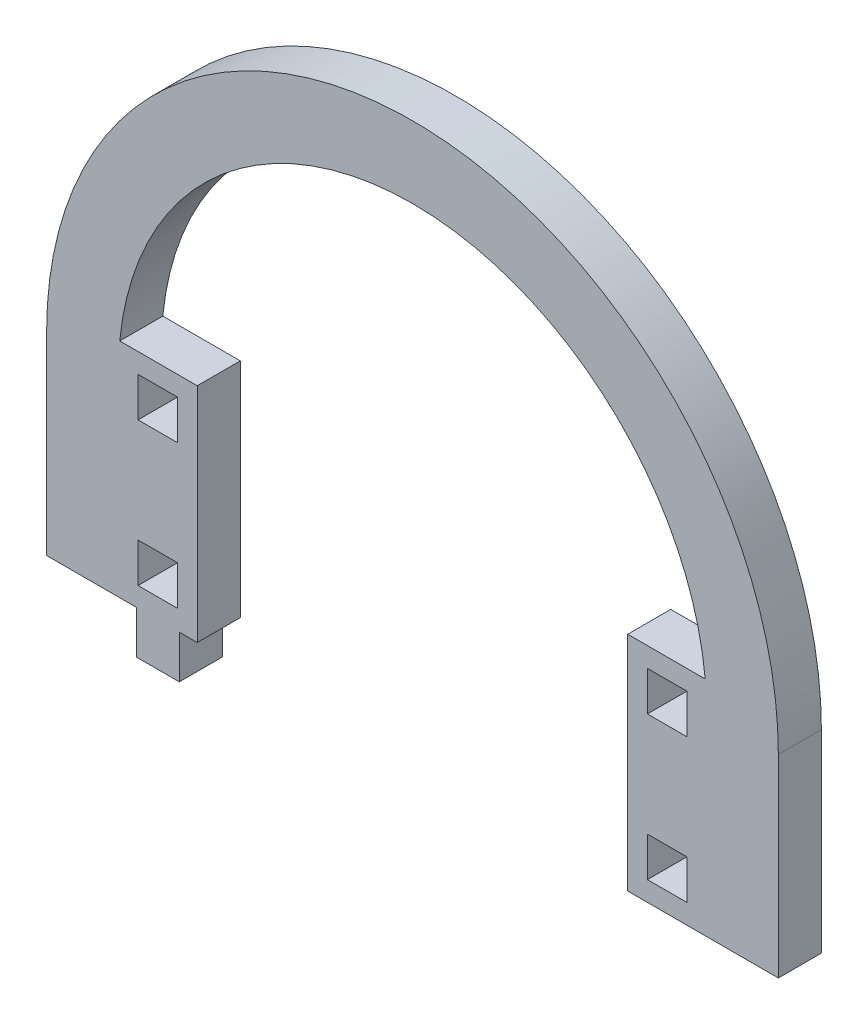
ISO-10303-21;
HEADER;
FILE_DESCRIPTION(('STEP AP214'),'2;1');
FILE_NAME('part.step','',(''),(''),'','','');
FILE_SCHEMA(('AUTOMOTIVE_DESIGN { 1 0 10303 214 1 1 1 1 }'));
ENDSEC;
DATA;
#1=APPLICATION_CONTEXT('core data for automotive mechanical design processes');
#2=APPLICATION_PROTOCOL_DEFINITION('international standard','automotive_design',2000,#1);
#3=PRODUCT_CONTEXT('',#1,'mechanical');
#4=PRODUCT('Part','Part','',(#3));
#5=PRODUCT_RELATED_PRODUCT_CATEGORY('part','',(#4));
#6=PRODUCT_DEFINITION_FORMATION('','',#4);
#7=PRODUCT_DEFINITION_CONTEXT('part definition',#1,'design');
#8=PRODUCT_DEFINITION('design','',#6,#7);
#9=PRODUCT_DEFINITION_SHAPE('','',#8);
#10=(LENGTH_UNIT() NAMED_UNIT(*) SI_UNIT(.MILLI.,.METRE.));
#11=(NAMED_UNIT(*) PLANE_ANGLE_UNIT() SI_UNIT($,.RADIAN.));
#12=(NAMED_UNIT(*) SI_UNIT($,.STERADIAN.) SOLID_ANGLE_UNIT());
#13=UNCERTAINTY_MEASURE_WITH_UNIT(LENGTH_MEASURE(1.E-05),#10,'distance_accuracy_value','');
#14=(GEOMETRIC_REPRESENTATION_CONTEXT(3) GLOBAL_UNCERTAINTY_ASSIGNED_CONTEXT((#13)) GLOBAL_UNIT_ASSIGNED_CONTEXT((#10,
#11,#12)) REPRESENTATION_CONTEXT('',''));
#15=CARTESIAN_POINT('',(0.,0.,0.));
#16=DIRECTION('',(0.,0.,1.));
#17=DIRECTION('',(1.,0.,0.));
#18=AXIS2_PLACEMENT_3D('',#15,#16,#17);
#19=CARTESIAN_POINT('',(3230.49866666937,1276.78177014644,6.));
#20=DIRECTION('',(0.,0.,1.));
#21=DIRECTION('',(1.,0.,0.));
#22=AXIS2_PLACEMENT_3D('',#19,#20,#21);
#23=PLANE('',#22);
#24=CARTESIAN_POINT('',(3230.49866666937,1276.78177014644,6.));
#25=DIRECTION('',(0.,0.,1.));
#26=DIRECTION('',(1.,0.,0.));
#27=AXIS2_PLACEMENT_3D('',#24,#25,#26);
#28=CIRCLE('',#27,50.9999999999999);
#29=CARTESIAN_POINT('',(3281.49866666937,1276.78177014644,6.));
#30=VERTEX_POINT('',#29);
#31=CARTESIAN_POINT('',(3179.49866666937,1276.78177014644,6.));
#32=VERTEX_POINT('',#31);
#33=EDGE_CURVE('E642',#30,#32,#28,.T.);
#34=ORIENTED_EDGE('',*,*,#33,.T.);
#35=DIRECTION('',(0.,-1.,0.));
#36=VECTOR('',#35,1.);
#37=CARTESIAN_POINT('',(3179.49866666937,1276.78177014644,6.));
#38=LINE('',#37,#36);
#39=CARTESIAN_POINT('',(3179.49866666937,1249.78177014644,6.));
#40=VERTEX_POINT('',#39);
#41=EDGE_CURVE('E646',#32,#40,#38,.T.);
#42=ORIENTED_EDGE('',*,*,#41,.T.);
#43=DIRECTION('',(1.,0.,0.));
#44=VECTOR('',#43,1.);
#45=CARTESIAN_POINT('',(3179.49866666937,1249.78177014644,6.));
#46=LINE('',#45,#44);
#47=CARTESIAN_POINT('',(3191.99866666937,1249.78177014644,6.));
#48=VERTEX_POINT('',#47);
#49=EDGE_CURVE('E650',#40,#48,#46,.T.);
#50=ORIENTED_EDGE('',*,*,#49,.T.);
#51=DIRECTION('',(0.,-1.,0.));
#52=VECTOR('',#51,1.);
#53=CARTESIAN_POINT('',(3191.99866666937,1249.78177014644,6.));
#54=LINE('',#53,#52);
#55=CARTESIAN_POINT('',(3191.99866666937,1243.78177014644,6.));
#56=VERTEX_POINT('',#55);
#57=EDGE_CURVE('E653',#48,#56,#54,.T.);
#58=ORIENTED_EDGE('',*,*,#57,.T.);
#59=DIRECTION('',(1.,0.,0.));
#60=VECTOR('',#59,1.);
#61=CARTESIAN_POINT('',(3191.99866666937,1243.78177014644,6.));
#62=LINE('',#61,#60);
#63=CARTESIAN_POINT('',(3197.99866666937,1243.78177014644,6.));
#64=VERTEX_POINT('',#63);
#65=EDGE_CURVE('E656',#56,#64,#62,.T.);
#66=ORIENTED_EDGE('',*,*,#65,.T.);
#67=DIRECTION('',(0.,1.,0.));
#68=VECTOR('',#67,1.);
#69=CARTESIAN_POINT('',(3197.99866666937,1243.78177014644,6.));
#70=LINE('',#69,#68);
#71=CARTESIAN_POINT('',(3197.99866666937,1249.78177014644,6.));
#72=VERTEX_POINT('',#71);
#73=EDGE_CURVE('E659',#64,#72,#70,.T.);
#74=ORIENTED_EDGE('',*,*,#73,.T.);
#75=DIRECTION('',(1.,0.,0.));
#76=VECTOR('',#75,1.);
#77=CARTESIAN_POINT('',(3197.99866666937,1249.78177014644,6.));
#78=LINE('',#77,#76);
#79=CARTESIAN_POINT('',(3200.49866666937,1249.78177014644,6.));
#80=VERTEX_POINT('',#79);
#81=EDGE_CURVE('E662',#72,#80,#78,.T.);
#82=ORIENTED_EDGE('',*,*,#81,.T.);
#83=DIRECTION('',(0.,-1.,0.));
#84=VECTOR('',#83,1.);
#85=CARTESIAN_POINT('',(3200.49866666937,1280.78177014644,6.));
#86=LINE('',#85,#84);
#87=CARTESIAN_POINT('',(3200.49866666937,1280.78177014644,6.));
#88=VERTEX_POINT('',#87);
#89=EDGE_CURVE('E665',#88,#80,#86,.T.);
#90=ORIENTED_EDGE('',*,*,#89,.F.);
#91=DIRECTION('',(-1.,0.,0.));
#92=VECTOR('',#91,1.);
#93=CARTESIAN_POINT('',(3200.49866666937,1280.78177014644,6.));
#94=LINE('',#93,#92);
#95=CARTESIAN_POINT('',(3189.69425514316,1280.78177014644,6.));
#96=VERTEX_POINT('',#95);
#97=EDGE_CURVE('E669',#88,#96,#94,.T.);
#98=ORIENTED_EDGE('',*,*,#97,.T.);
#99=CARTESIAN_POINT('',(3230.49866666937,1276.78177014644,6.));
#100=DIRECTION('',(0.,0.,1.));
#101=DIRECTION('',(1.,0.,0.));
#102=AXIS2_PLACEMENT_3D('',#99,#100,#101);
#103=CIRCLE('',#102,41.0000000000003);
#104=CARTESIAN_POINT('',(3271.30307819558,1280.78177014644,6.));
#105=VERTEX_POINT('',#104);
#106=EDGE_CURVE('E672',#105,#96,#103,.T.);
#107=ORIENTED_EDGE('',*,*,#106,.F.);
#108=DIRECTION('',(-1.,0.,0.));
#109=VECTOR('',#108,1.);
#110=CARTESIAN_POINT('',(3271.30307819558,1280.78177014644,6.));
#111=LINE('',#110,#109);
#112=CARTESIAN_POINT('',(3260.49866666937,1280.78177014644,6.));
#113=VERTEX_POINT('',#112);
#114=EDGE_CURVE('E676',#105,#113,#111,.T.);
#115=ORIENTED_EDGE('',*,*,#114,.T.);
#116=DIRECTION('',(0.,-1.,0.));
#117=VECTOR('',#116,1.);
#118=CARTESIAN_POINT('',(3260.49866666937,1280.78177014644,6.));
#119=LINE('',#118,#117);
#120=CARTESIAN_POINT('',(3260.49866666937,1249.78177014644,6.));
#121=VERTEX_POINT('',#120);
#122=EDGE_CURVE('E679',#113,#121,#119,.T.);
#123=ORIENTED_EDGE('',*,*,#122,.T.);
#124=DIRECTION('',(1.,0.,0.));
#125=VECTOR('',#124,1.);
#126=CARTESIAN_POINT('',(3260.49866666937,1249.78177014644,6.));
#127=LINE('',#126,#125);
#128=CARTESIAN_POINT('',(3281.49866666937,1249.78177014644,6.));
#129=VERTEX_POINT('',#128);
#130=EDGE_CURVE('E682',#121,#129,#127,.T.);
#131=ORIENTED_EDGE('',*,*,#130,.T.);
#132=DIRECTION('',(0.,-1.,0.));
#133=VECTOR('',#132,1.);
#134=CARTESIAN_POINT('',(3281.49866666937,1276.78177014644,6.));
#135=LINE('',#134,#133);
#136=EDGE_CURVE('E685',#30,#129,#135,.T.);
#137=ORIENTED_EDGE('',*,*,#136,.F.);
#138=EDGE_LOOP('',(#34,#42,#50,#58,#66,#74,#82,#90,#98,#107,#115,#123,#131,#137));
#139=FACE_BOUND('',#138,.T.);
#140=DIRECTION('',(0.,1.,0.));
#141=VECTOR('',#140,1.);
#142=CARTESIAN_POINT('',(3197.74866666937,0.,6.));
#143=LINE('',#142,#141);
#144=CARTESIAN_POINT('',(3197.74866666937,1272.53177014644,6.));
#145=VERTEX_POINT('',#144);
#146=CARTESIAN_POINT('',(3197.74866666937,1278.03177014644,6.));
#147=VERTEX_POINT('',#146);
#148=EDGE_CURVE('E602',#145,#147,#143,.T.);
#149=ORIENTED_EDGE('',*,*,#148,.F.);
#150=DIRECTION('',(1.,0.,0.));
#151=VECTOR('',#150,1.);
#152=CARTESIAN_POINT('',(0.,1272.53177014644,6.));
#153=LINE('',#152,#151);
#154=CARTESIAN_POINT('',(3192.24866666937,1272.53177014644,6.));
#155=VERTEX_POINT('',#154);
#156=EDGE_CURVE('E599',#155,#145,#153,.T.);
#157=ORIENTED_EDGE('',*,*,#156,.F.);
#158=DIRECTION('',(0.,-1.,0.));
#159=VECTOR('',#158,1.);
#160=CARTESIAN_POINT('',(3192.24866666937,0.,6.));
#161=LINE('',#160,#159);
#162=CARTESIAN_POINT('',(3192.24866666937,1278.03177014644,6.));
#163=VERTEX_POINT('',#162);
#164=EDGE_CURVE('E610',#163,#155,#161,.T.);
#165=ORIENTED_EDGE('',*,*,#164,.F.);
#166=DIRECTION('',(-1.,0.,0.));
#167=VECTOR('',#166,1.);
#168=CARTESIAN_POINT('',(0.,1278.03177014644,6.));
#169=LINE('',#168,#167);
#170=EDGE_CURVE('E606',#147,#163,#169,.T.);
#171=ORIENTED_EDGE('',*,*,#170,.F.);
#172=EDGE_LOOP('',(#149,#157,#165,#171));
#173=FACE_BOUND('',#172,.T.);
#174=DIRECTION('',(0.,1.,0.));
#175=VECTOR('',#174,1.);
#176=CARTESIAN_POINT('',(3197.74866666937,0.,6.));
#177=LINE('',#176,#175);
#178=CARTESIAN_POINT('',(3197.74866666937,1252.53177014644,6.));
#179=VERTEX_POINT('',#178);
#180=CARTESIAN_POINT('',(3197.74866666937,1258.03177014644,6.));
#181=VERTEX_POINT('',#180);
#182=EDGE_CURVE('E559',#179,#181,#177,.T.);
#183=ORIENTED_EDGE('',*,*,#182,.F.);
#184=DIRECTION('',(1.,0.,0.));
#185=VECTOR('',#184,1.);
#186=CARTESIAN_POINT('',(0.,1252.53177014644,6.));
#187=LINE('',#186,#185);
#188=CARTESIAN_POINT('',(3192.24866666937,1252.53177014644,6.));
#189=VERTEX_POINT('',#188);
#190=EDGE_CURVE('E556',#189,#179,#187,.T.);
#191=ORIENTED_EDGE('',*,*,#190,.F.);
#192=DIRECTION('',(0.,-1.,0.));
#193=VECTOR('',#192,1.);
#194=CARTESIAN_POINT('',(3192.24866666937,0.,6.));
#195=LINE('',#194,#193);
#196=CARTESIAN_POINT('',(3192.24866666937,1258.03177014644,6.));
#197=VERTEX_POINT('',#196);
#198=EDGE_CURVE('E567',#197,#189,#195,.T.);
#199=ORIENTED_EDGE('',*,*,#198,.F.);
#200=DIRECTION('',(-1.,0.,0.));
#201=VECTOR('',#200,1.);
#202=CARTESIAN_POINT('',(0.,1258.03177014644,6.));
#203=LINE('',#202,#201);
#204=EDGE_CURVE('E563',#181,#197,#203,.T.);
#205=ORIENTED_EDGE('',*,*,#204,.F.);
#206=EDGE_LOOP('',(#183,#191,#199,#205));
#207=FACE_BOUND('',#206,.T.);
#208=DIRECTION('',(0.,1.,0.));
#209=VECTOR('',#208,1.);
#210=CARTESIAN_POINT('',(3268.74866666937,0.,6.));
#211=LINE('',#210,#209);
#212=CARTESIAN_POINT('',(3268.74866666937,1272.53177014644,6.));
#213=VERTEX_POINT('',#212);
#214=CARTESIAN_POINT('',(3268.74866666937,1278.03177014644,6.));
#215=VERTEX_POINT('',#214);
#216=EDGE_CURVE('E516',#213,#215,#211,.T.);
#217=ORIENTED_EDGE('',*,*,#216,.F.);
#218=DIRECTION('',(1.,0.,0.));
#219=VECTOR('',#218,1.);
#220=CARTESIAN_POINT('',(0.,1272.53177014644,6.));
#221=LINE('',#220,#219);
#222=CARTESIAN_POINT('',(3263.24866666937,1272.53177014644,6.));
#223=VERTEX_POINT('',#222);
#224=EDGE_CURVE('E513',#223,#213,#221,.T.);
#225=ORIENTED_EDGE('',*,*,#224,.F.);
#226=DIRECTION('',(0.,-1.,0.));
#227=VECTOR('',#226,1.);
#228=CARTESIAN_POINT('',(3263.24866666937,0.,6.));
#229=LINE('',#228,#227);
#230=CARTESIAN_POINT('',(3263.24866666937,1278.03177014644,6.));
#231=VERTEX_POINT('',#230);
#232=EDGE_CURVE('E524',#231,#223,#229,.T.);
#233=ORIENTED_EDGE('',*,*,#232,.F.);
#234=DIRECTION('',(-1.,0.,0.));
#235=VECTOR('',#234,1.);
#236=CARTESIAN_POINT('',(0.,1278.03177014644,6.));
#237=LINE('',#236,#235);
#238=EDGE_CURVE('E520',#215,#231,#237,.T.);
#239=ORIENTED_EDGE('',*,*,#238,.F.);
#240=EDGE_LOOP('',(#217,#225,#233,#239));
#241=FACE_BOUND('',#240,.T.);
#242=DIRECTION('',(0.,1.,0.));
#243=VECTOR('',#242,1.);
#244=CARTESIAN_POINT('',(3268.74866666937,0.,6.));
#245=LINE('',#244,#243);
#246=CARTESIAN_POINT('',(3268.74866666937,1252.53177014644,6.));
#247=VERTEX_POINT('',#246);
#248=CARTESIAN_POINT('',(3268.74866666937,1258.03177014644,6.));
#249=VERTEX_POINT('',#248);
#250=EDGE_CURVE('E474',#247,#249,#245,.T.);
#251=ORIENTED_EDGE('',*,*,#250,.F.);
#252=DIRECTION('',(1.,0.,0.));
#253=VECTOR('',#252,1.);
#254=CARTESIAN_POINT('',(0.,1252.53177014644,6.));
#255=LINE('',#254,#253);
#256=CARTESIAN_POINT('',(3263.24866666937,1252.53177014644,6.));
#257=VERTEX_POINT('',#256);
#258=EDGE_CURVE('E465',#257,#247,#255,.T.);
#259=ORIENTED_EDGE('',*,*,#258,.F.);
#260=DIRECTION('',(0.,-1.,0.));
#261=VECTOR('',#260,1.);
#262=CARTESIAN_POINT('',(3263.24866666937,0.,6.));
#263=LINE('',#262,#261);
#264=CARTESIAN_POINT('',(3263.24866666937,1258.03177014644,6.));
#265=VERTEX_POINT('',#264);
#266=EDGE_CURVE('E491',#265,#257,#263,.T.);
#267=ORIENTED_EDGE('',*,*,#266,.F.);
#268=DIRECTION('',(-1.,0.,0.));
#269=VECTOR('',#268,1.);
#270=CARTESIAN_POINT('',(0.,1258.03177014644,6.));
#271=LINE('',#270,#269);
#272=EDGE_CURVE('E487',#249,#265,#271,.T.);
#273=ORIENTED_EDGE('',*,*,#272,.F.);
#274=EDGE_LOOP('',(#251,#259,#267,#273));
#275=FACE_BOUND('',#274,.T.);
#276=ADVANCED_FACE('F267',(#139,#173,#207,#241,#275),#23,.T.);
#277=CARTESIAN_POINT('',(3230.49866666937,1276.78177014644,0.));
#278=DIRECTION('',(0.,0.,1.));
#279=DIRECTION('',(1.,0.,0.));
#280=AXIS2_PLACEMENT_3D('',#277,#278,#279);
#281=PLANE('',#280);
#282=DIRECTION('',(1.,0.,0.));
#283=VECTOR('',#282,1.);
#284=CARTESIAN_POINT('',(0.,1272.53177014644,0.));
#285=LINE('',#284,#283);
#286=CARTESIAN_POINT('',(3263.24866666937,1272.53177014644,0.));
#287=VERTEX_POINT('',#286);
#288=CARTESIAN_POINT('',(3268.74866666937,1272.53177014644,0.));
#289=VERTEX_POINT('',#288);
#290=EDGE_CURVE('E483',#287,#289,#285,.T.);
#291=ORIENTED_EDGE('',*,*,#290,.T.);
#292=DIRECTION('',(0.,1.,0.));
#293=VECTOR('',#292,1.);
#294=CARTESIAN_POINT('',(3268.74866666937,0.,0.));
#295=LINE('',#294,#293);
#296=CARTESIAN_POINT('',(3268.74866666937,1278.03177014644,0.));
#297=VERTEX_POINT('',#296);
#298=EDGE_CURVE('E531',#289,#297,#295,.T.);
#299=ORIENTED_EDGE('',*,*,#298,.T.);
#300=DIRECTION('',(-1.,0.,0.));
#301=VECTOR('',#300,1.);
#302=CARTESIAN_POINT('',(0.,1278.03177014644,0.));
#303=LINE('',#302,#301);
#304=CARTESIAN_POINT('',(3263.24866666937,1278.03177014644,0.));
#305=VERTEX_POINT('',#304);
#306=EDGE_CURVE('E535',#297,#305,#303,.T.);
#307=ORIENTED_EDGE('',*,*,#306,.T.);
#308=DIRECTION('',(0.,-1.,0.));
#309=VECTOR('',#308,1.);
#310=CARTESIAN_POINT('',(3263.24866666937,0.,0.));
#311=LINE('',#310,#309);
#312=EDGE_CURVE('E517',#305,#287,#311,.T.);
#313=ORIENTED_EDGE('',*,*,#312,.T.);
#314=EDGE_LOOP('',(#291,#299,#307,#313));
#315=FACE_BOUND('',#314,.T.);
#316=DIRECTION('',(1.,0.,0.));
#317=VECTOR('',#316,1.);
#318=CARTESIAN_POINT('',(0.,1272.53177014644,0.));
#319=LINE('',#318,#317);
#320=CARTESIAN_POINT('',(3192.24866666937,1272.53177014644,0.));
#321=VERTEX_POINT('',#320);
#322=CARTESIAN_POINT('',(3197.74866666937,1272.53177014644,0.));
#323=VERTEX_POINT('',#322);
#324=EDGE_CURVE('E598',#321,#323,#319,.T.);
#325=ORIENTED_EDGE('',*,*,#324,.T.);
#326=DIRECTION('',(0.,1.,0.));
#327=VECTOR('',#326,1.);
#328=CARTESIAN_POINT('',(3197.74866666937,0.,0.));
#329=LINE('',#328,#327);
#330=CARTESIAN_POINT('',(3197.74866666937,1278.03177014644,0.));
#331=VERTEX_POINT('',#330);
#332=EDGE_CURVE('E617',#323,#331,#329,.T.);
#333=ORIENTED_EDGE('',*,*,#332,.T.);
#334=DIRECTION('',(-1.,0.,0.));
#335=VECTOR('',#334,1.);
#336=CARTESIAN_POINT('',(0.,1278.03177014644,0.));
#337=LINE('',#336,#335);
#338=CARTESIAN_POINT('',(3192.24866666937,1278.03177014644,0.));
#339=VERTEX_POINT('',#338);
#340=EDGE_CURVE('E621',#331,#339,#337,.T.);
#341=ORIENTED_EDGE('',*,*,#340,.T.);
#342=DIRECTION('',(0.,-1.,0.));
#343=VECTOR('',#342,1.);
#344=CARTESIAN_POINT('',(3192.24866666937,0.,0.));
#345=LINE('',#344,#343);
#346=EDGE_CURVE('E603',#339,#321,#345,.T.);
#347=ORIENTED_EDGE('',*,*,#346,.T.);
#348=EDGE_LOOP('',(#325,#333,#341,#347));
#349=FACE_BOUND('',#348,.T.);
#350=CARTESIAN_POINT('',(3230.49866666937,1276.78177014644,0.));
#351=DIRECTION('',(0.,0.,1.));
#352=DIRECTION('',(1.,0.,0.));
#353=AXIS2_PLACEMENT_3D('',#350,#351,#352);
#354=CIRCLE('',#353,50.9999999999999);
#355=CARTESIAN_POINT('',(3281.49866666937,1276.78177014644,0.));
#356=VERTEX_POINT('',#355);
#357=CARTESIAN_POINT('',(3179.49866666937,1276.78177014644,0.));
#358=VERTEX_POINT('',#357);
#359=EDGE_CURVE('E641',#356,#358,#354,.T.);
#360=ORIENTED_EDGE('',*,*,#359,.F.);
#361=DIRECTION('',(0.,-1.,0.));
#362=VECTOR('',#361,1.);
#363=CARTESIAN_POINT('',(3281.49866666937,1276.78177014644,0.));
#364=LINE('',#363,#362);
#365=CARTESIAN_POINT('',(3281.49866666937,1249.78177014644,0.));
#366=VERTEX_POINT('',#365);
#367=EDGE_CURVE('E647',#356,#366,#364,.T.);
#368=ORIENTED_EDGE('',*,*,#367,.T.);
#369=DIRECTION('',(1.,0.,0.));
#370=VECTOR('',#369,1.);
#371=CARTESIAN_POINT('',(3271.49866666937,1249.78177014644,0.));
#372=LINE('',#371,#370);
#373=CARTESIAN_POINT('',(3260.49866666937,1249.78177014644,0.));
#374=VERTEX_POINT('',#373);
#375=EDGE_CURVE('E731',#374,#366,#372,.T.);
#376=ORIENTED_EDGE('',*,*,#375,.F.);
#377=DIRECTION('',(0.,-1.,0.));
#378=VECTOR('',#377,1.);
#379=CARTESIAN_POINT('',(3260.49866666937,1280.78177014644,0.));
#380=LINE('',#379,#378);
#381=CARTESIAN_POINT('',(3260.49866666937,1280.78177014644,0.));
#382=VERTEX_POINT('',#381);
#383=EDGE_CURVE('E727',#382,#374,#380,.T.);
#384=ORIENTED_EDGE('',*,*,#383,.F.);
#385=DIRECTION('',(-1.,0.,0.));
#386=VECTOR('',#385,1.);
#387=CARTESIAN_POINT('',(3271.30307819558,1280.78177014644,0.));
#388=LINE('',#387,#386);
#389=CARTESIAN_POINT('',(3271.30307819558,1280.78177014644,0.));
#390=VERTEX_POINT('',#389);
#391=EDGE_CURVE('E724',#390,#382,#388,.T.);
#392=ORIENTED_EDGE('',*,*,#391,.F.);
#393=CARTESIAN_POINT('',(3230.49866666937,1276.78177014644,0.));
#394=DIRECTION('',(0.,0.,1.));
#395=DIRECTION('',(1.,0.,0.));
#396=AXIS2_PLACEMENT_3D('',#393,#394,#395);
#397=CIRCLE('',#396,41.0000000000003);
#398=CARTESIAN_POINT('',(3189.69425514316,1280.78177014644,0.));
#399=VERTEX_POINT('',#398);
#400=EDGE_CURVE('E720',#390,#399,#397,.T.);
#401=ORIENTED_EDGE('',*,*,#400,.T.);
#402=DIRECTION('',(-1.,0.,0.));
#403=VECTOR('',#402,1.);
#404=CARTESIAN_POINT('',(3200.49866666937,1280.78177014644,0.));
#405=LINE('',#404,#403);
#406=CARTESIAN_POINT('',(3200.49866666937,1280.78177014644,0.));
#407=VERTEX_POINT('',#406);
#408=EDGE_CURVE('E716',#407,#399,#405,.T.);
#409=ORIENTED_EDGE('',*,*,#408,.F.);
#410=DIRECTION('',(0.,-1.,0.));
#411=VECTOR('',#410,1.);
#412=CARTESIAN_POINT('',(3200.49866666937,1280.78177014644,0.));
#413=LINE('',#412,#411);
#414=CARTESIAN_POINT('',(3200.49866666937,1249.78177014644,0.));
#415=VERTEX_POINT('',#414);
#416=EDGE_CURVE('E712',#407,#415,#413,.T.);
#417=ORIENTED_EDGE('',*,*,#416,.T.);
#418=DIRECTION('',(1.,0.,0.));
#419=VECTOR('',#418,1.);
#420=CARTESIAN_POINT('',(3197.99866666937,1249.78177014644,0.));
#421=LINE('',#420,#419);
#422=CARTESIAN_POINT('',(3197.99866666937,1249.78177014644,0.));
#423=VERTEX_POINT('',#422);
#424=EDGE_CURVE('E708',#423,#415,#421,.T.);
#425=ORIENTED_EDGE('',*,*,#424,.F.);
#426=DIRECTION('',(0.,1.,0.));
#427=VECTOR('',#426,1.);
#428=CARTESIAN_POINT('',(3197.99866666937,1243.78177014644,0.));
#429=LINE('',#428,#427);
#430=CARTESIAN_POINT('',(3197.99866666937,1243.78177014644,0.));
#431=VERTEX_POINT('',#430);
#432=EDGE_CURVE('E705',#431,#423,#429,.T.);
#433=ORIENTED_EDGE('',*,*,#432,.F.);
#434=DIRECTION('',(1.,0.,0.));
#435=VECTOR('',#434,1.);
#436=CARTESIAN_POINT('',(3191.99866666937,1243.78177014644,0.));
#437=LINE('',#436,#435);
#438=CARTESIAN_POINT('',(3191.99866666937,1243.78177014644,0.));
#439=VERTEX_POINT('',#438);
#440=EDGE_CURVE('E702',#439,#431,#437,.T.);
#441=ORIENTED_EDGE('',*,*,#440,.F.);
#442=DIRECTION('',(0.,-1.,0.));
#443=VECTOR('',#442,1.);
#444=CARTESIAN_POINT('',(3191.99866666937,1249.78177014644,0.));
#445=LINE('',#444,#443);
#446=CARTESIAN_POINT('',(3191.99866666937,1249.78177014644,0.));
#447=VERTEX_POINT('',#446);
#448=EDGE_CURVE('E699',#447,#439,#445,.T.);
#449=ORIENTED_EDGE('',*,*,#448,.F.);
#450=DIRECTION('',(1.,0.,0.));
#451=VECTOR('',#450,1.);
#452=CARTESIAN_POINT('',(3179.49866666937,1249.78177014644,0.));
#453=LINE('',#452,#451);
#454=CARTESIAN_POINT('',(3179.49866666937,1249.78177014644,0.));
#455=VERTEX_POINT('',#454);
#456=EDGE_CURVE('E696',#455,#447,#453,.T.);
#457=ORIENTED_EDGE('',*,*,#456,.F.);
#458=DIRECTION('',(0.,-1.,0.));
#459=VECTOR('',#458,1.);
#460=CARTESIAN_POINT('',(3179.49866666937,1276.78177014644,0.));
#461=LINE('',#460,#459);
#462=EDGE_CURVE('E693',#358,#455,#461,.T.);
#463=ORIENTED_EDGE('',*,*,#462,.F.);
#464=EDGE_LOOP('',(#360,#368,#376,#384,#392,#401,#409,#417,#425,#433,#441,#449,#457,#463));
#465=FACE_BOUND('',#464,.T.);
#466=DIRECTION('',(1.,0.,0.));
#467=VECTOR('',#466,1.);
#468=CARTESIAN_POINT('',(0.,1252.53177014644,0.));
#469=LINE('',#468,#467);
#470=CARTESIAN_POINT('',(3192.24866666937,1252.53177014644,0.));
#471=VERTEX_POINT('',#470);
#472=CARTESIAN_POINT('',(3197.74866666937,1252.53177014644,0.));
#473=VERTEX_POINT('',#472);
#474=EDGE_CURVE('E555',#471,#473,#469,.T.);
#475=ORIENTED_EDGE('',*,*,#474,.T.);
#476=DIRECTION('',(0.,1.,0.));
#477=VECTOR('',#476,1.);
#478=CARTESIAN_POINT('',(3197.74866666937,0.,0.));
#479=LINE('',#478,#477);
#480=CARTESIAN_POINT('',(3197.74866666937,1258.03177014644,0.));
#481=VERTEX_POINT('',#480);
#482=EDGE_CURVE('E574',#473,#481,#479,.T.);
#483=ORIENTED_EDGE('',*,*,#482,.T.);
#484=DIRECTION('',(-1.,0.,0.));
#485=VECTOR('',#484,1.);
#486=CARTESIAN_POINT('',(0.,1258.03177014644,0.));
#487=LINE('',#486,#485);
#488=CARTESIAN_POINT('',(3192.24866666937,1258.03177014644,0.));
#489=VERTEX_POINT('',#488);
#490=EDGE_CURVE('E578',#481,#489,#487,.T.);
#491=ORIENTED_EDGE('',*,*,#490,.T.);
#492=DIRECTION('',(0.,-1.,0.));
#493=VECTOR('',#492,1.);
#494=CARTESIAN_POINT('',(3192.24866666937,0.,0.));
#495=LINE('',#494,#493);
#496=EDGE_CURVE('E560',#489,#471,#495,.T.);
#497=ORIENTED_EDGE('',*,*,#496,.T.);
#498=EDGE_LOOP('',(#475,#483,#491,#497));
#499=FACE_BOUND('',#498,.T.);
#500=DIRECTION('',(1.,0.,0.));
#501=VECTOR('',#500,1.);
#502=CARTESIAN_POINT('',(0.,1252.53177014644,0.));
#503=LINE('',#502,#501);
#504=CARTESIAN_POINT('',(3263.24866666937,1252.53177014644,0.));
#505=VERTEX_POINT('',#504);
#506=CARTESIAN_POINT('',(3268.74866666937,1252.53177014644,0.));
#507=VERTEX_POINT('',#506);
#508=EDGE_CURVE('E291',#505,#507,#503,.T.);
#509=ORIENTED_EDGE('',*,*,#508,.T.);
#510=DIRECTION('',(0.,1.,0.));
#511=VECTOR('',#510,1.);
#512=CARTESIAN_POINT('',(3268.74866666937,0.,0.));
#513=LINE('',#512,#511);
#514=CARTESIAN_POINT('',(3268.74866666937,1258.03177014644,0.));
#515=VERTEX_POINT('',#514);
#516=EDGE_CURVE('E481',#507,#515,#513,.T.);
#517=ORIENTED_EDGE('',*,*,#516,.T.);
#518=DIRECTION('',(-1.,0.,0.));
#519=VECTOR('',#518,1.);
#520=CARTESIAN_POINT('',(0.,1258.03177014644,0.));
#521=LINE('',#520,#519);
#522=CARTESIAN_POINT('',(3263.24866666937,1258.03177014644,0.));
#523=VERTEX_POINT('',#522);
#524=EDGE_CURVE('E500',#515,#523,#521,.T.);
#525=ORIENTED_EDGE('',*,*,#524,.T.);
#526=DIRECTION('',(0.,-1.,0.));
#527=VECTOR('',#526,1.);
#528=CARTESIAN_POINT('',(3263.24866666937,0.,0.));
#529=LINE('',#528,#527);
#530=EDGE_CURVE('E475',#523,#505,#529,.T.);
#531=ORIENTED_EDGE('',*,*,#530,.T.);
#532=EDGE_LOOP('',(#509,#517,#525,#531));
#533=FACE_BOUND('',#532,.T.);
#534=ADVANCED_FACE('F790',(#315,#349,#465,#499,#533),#281,.F.);
#535=CARTESIAN_POINT('',(3230.49866666937,1276.78177014644,6.));
#536=DIRECTION('',(0.,0.,-1.));
#537=DIRECTION('',(-1.,0.,0.));
#538=AXIS2_PLACEMENT_3D('',#535,#536,#537);
#539=CYLINDRICAL_SURFACE('',#538,50.9999999999999);
#540=ORIENTED_EDGE('',*,*,#359,.T.);
#541=DIRECTION('',(0.,0.,-1.));
#542=VECTOR('',#541,1.);
#543=CARTESIAN_POINT('',(3179.49866666937,1276.78177014644,6.));
#544=LINE('',#543,#542);
#545=EDGE_CURVE('E12',#32,#358,#544,.T.);
#546=ORIENTED_EDGE('',*,*,#545,.F.);
#547=ORIENTED_EDGE('',*,*,#33,.F.);
#548=DIRECTION('',(0.,0.,-1.));
#549=VECTOR('',#548,1.);
#550=CARTESIAN_POINT('',(3281.49866666937,1276.78177014644,6.));
#551=LINE('',#550,#549);
#552=EDGE_CURVE('E689',#30,#356,#551,.T.);
#553=ORIENTED_EDGE('',*,*,#552,.T.);
#554=EDGE_LOOP('',(#540,#546,#547,#553));
#555=FACE_BOUND('',#554,.T.);
#556=ADVANCED_FACE('F269',(#555),#539,.T.);
#557=CARTESIAN_POINT('',(3179.49866666937,1276.78177014644,6.));
#558=DIRECTION('',(1.,0.,0.));
#559=DIRECTION('',(0.,0.,-1.));
#560=AXIS2_PLACEMENT_3D('',#557,#558,#559);
#561=PLANE('',#560);
#562=ORIENTED_EDGE('',*,*,#462,.T.);
#563=DIRECTION('',(0.,0.,-1.));
#564=VECTOR('',#563,1.);
#565=CARTESIAN_POINT('',(3179.49866666937,1249.78177014644,6.));
#566=LINE('',#565,#564);
#567=EDGE_CURVE('E276',#40,#455,#566,.T.);
#568=ORIENTED_EDGE('',*,*,#567,.F.);
#569=ORIENTED_EDGE('',*,*,#41,.F.);
#570=ORIENTED_EDGE('',*,*,#545,.T.);
#571=EDGE_LOOP('',(#562,#568,#569,#570));
#572=FACE_BOUND('',#571,.T.);
#573=ADVANCED_FACE('F809',(#572),#561,.F.);
#574=CARTESIAN_POINT('',(3179.49866666937,1249.78177014644,6.));
#575=DIRECTION('',(0.,1.,0.));
#576=DIRECTION('',(0.,0.,1.));
#577=AXIS2_PLACEMENT_3D('',#574,#575,#576);
#578=PLANE('',#577);
#579=ORIENTED_EDGE('',*,*,#456,.T.);
#580=DIRECTION('',(0.,0.,-1.));
#581=VECTOR('',#580,1.);
#582=CARTESIAN_POINT('',(3191.99866666937,1249.78177014644,6.));
#583=LINE('',#582,#581);
#584=EDGE_CURVE('E775',#48,#447,#583,.T.);
#585=ORIENTED_EDGE('',*,*,#584,.F.);
#586=ORIENTED_EDGE('',*,*,#49,.F.);
#587=ORIENTED_EDGE('',*,*,#567,.T.);
#588=EDGE_LOOP('',(#579,#585,#586,#587));
#589=FACE_BOUND('',#588,.T.);
#590=ADVANCED_FACE('F784',(#589),#578,.F.);
#591=CARTESIAN_POINT('',(3191.99866666937,1249.78177014644,6.));
#592=DIRECTION('',(1.,0.,0.));
#593=DIRECTION('',(0.,0.,-1.));
#594=AXIS2_PLACEMENT_3D('',#591,#592,#593);
#595=PLANE('',#594);
#596=ORIENTED_EDGE('',*,*,#448,.T.);
#597=DIRECTION('',(0.,0.,-1.));
#598=VECTOR('',#597,1.);
#599=CARTESIAN_POINT('',(3191.99866666937,1243.78177014644,6.));
#600=LINE('',#599,#598);
#601=EDGE_CURVE('E771',#56,#439,#600,.T.);
#602=ORIENTED_EDGE('',*,*,#601,.F.);
#603=ORIENTED_EDGE('',*,*,#57,.F.);
#604=ORIENTED_EDGE('',*,*,#584,.T.);
#605=EDGE_LOOP('',(#596,#602,#603,#604));
#606=FACE_BOUND('',#605,.T.);
#607=ADVANCED_FACE('F796',(#606),#595,.F.);
#608=CARTESIAN_POINT('',(3191.99866666937,1243.78177014644,6.));
#609=DIRECTION('',(0.,1.,0.));
#610=DIRECTION('',(0.,0.,1.));
#611=AXIS2_PLACEMENT_3D('',#608,#609,#610);
#612=PLANE('',#611);
#613=ORIENTED_EDGE('',*,*,#440,.T.);
#614=DIRECTION('',(0.,0.,-1.));
#615=VECTOR('',#614,1.);
#616=CARTESIAN_POINT('',(3197.99866666937,1243.78177014644,6.));
#617=LINE('',#616,#615);
#618=EDGE_CURVE('E767',#64,#431,#617,.T.);
#619=ORIENTED_EDGE('',*,*,#618,.F.);
#620=ORIENTED_EDGE('',*,*,#65,.F.);
#621=ORIENTED_EDGE('',*,*,#601,.T.);
#622=EDGE_LOOP('',(#613,#619,#620,#621));
#623=FACE_BOUND('',#622,.T.);
#624=ADVANCED_FACE('F800',(#623),#612,.F.);
#625=CARTESIAN_POINT('',(3197.99866666937,1243.78177014644,6.));
#626=DIRECTION('',(-1.,0.,0.));
#627=DIRECTION('',(0.,0.,1.));
#628=AXIS2_PLACEMENT_3D('',#625,#626,#627);
#629=PLANE('',#628);
#630=ORIENTED_EDGE('',*,*,#432,.T.);
#631=DIRECTION('',(0.,0.,-1.));
#632=VECTOR('',#631,1.);
#633=CARTESIAN_POINT('',(3197.99866666937,1249.78177014644,6.));
#634=LINE('',#633,#632);
#635=EDGE_CURVE('E763',#72,#423,#634,.T.);
#636=ORIENTED_EDGE('',*,*,#635,.F.);
#637=ORIENTED_EDGE('',*,*,#73,.F.);
#638=ORIENTED_EDGE('',*,*,#618,.T.);
#639=EDGE_LOOP('',(#630,#636,#637,#638));
#640=FACE_BOUND('',#639,.T.);
#641=ADVANCED_FACE('F847',(#640),#629,.F.);
#642=CARTESIAN_POINT('',(3197.99866666937,1249.78177014644,6.));
#643=DIRECTION('',(0.,1.,0.));
#644=DIRECTION('',(0.,0.,1.));
#645=AXIS2_PLACEMENT_3D('',#642,#643,#644);
#646=PLANE('',#645);
#647=ORIENTED_EDGE('',*,*,#424,.T.);
#648=DIRECTION('',(0.,0.,-1.));
#649=VECTOR('',#648,1.);
#650=CARTESIAN_POINT('',(3200.49866666937,1249.78177014644,6.));
#651=LINE('',#650,#649);
#652=EDGE_CURVE('E760',#80,#415,#651,.T.);
#653=ORIENTED_EDGE('',*,*,#652,.F.);
#654=ORIENTED_EDGE('',*,*,#81,.F.);
#655=ORIENTED_EDGE('',*,*,#635,.T.);
#656=EDGE_LOOP('',(#647,#653,#654,#655));
#657=FACE_BOUND('',#656,.T.);
#658=ADVANCED_FACE('F845',(#657),#646,.F.);
#659=CARTESIAN_POINT('',(3200.49866666937,1280.78177014644,6.));
#660=DIRECTION('',(1.,0.,0.));
#661=DIRECTION('',(0.,0.,-1.));
#662=AXIS2_PLACEMENT_3D('',#659,#660,#661);
#663=PLANE('',#662);
#664=ORIENTED_EDGE('',*,*,#416,.F.);
#665=DIRECTION('',(0.,0.,-1.));
#666=VECTOR('',#665,1.);
#667=CARTESIAN_POINT('',(3200.49866666937,1280.78177014644,6.));
#668=LINE('',#667,#666);
#669=EDGE_CURVE('E757',#88,#407,#668,.T.);
#670=ORIENTED_EDGE('',*,*,#669,.F.);
#671=ORIENTED_EDGE('',*,*,#89,.T.);
#672=ORIENTED_EDGE('',*,*,#652,.T.);
#673=EDGE_LOOP('',(#664,#670,#671,#672));
#674=FACE_BOUND('',#673,.T.);
#675=ADVANCED_FACE('F840',(#674),#663,.T.);
#676=CARTESIAN_POINT('',(3200.49866666937,1280.78177014644,6.));
#677=DIRECTION('',(0.,-1.,0.));
#678=DIRECTION('',(0.,0.,-1.));
#679=AXIS2_PLACEMENT_3D('',#676,#677,#678);
#680=PLANE('',#679);
#681=ORIENTED_EDGE('',*,*,#408,.T.);
#682=DIRECTION('',(0.,0.,-1.));
#683=VECTOR('',#682,1.);
#684=CARTESIAN_POINT('',(3189.69425514316,1280.78177014644,6.));
#685=LINE('',#684,#683);
#686=EDGE_CURVE('E754',#96,#399,#685,.T.);
#687=ORIENTED_EDGE('',*,*,#686,.F.);
#688=ORIENTED_EDGE('',*,*,#97,.F.);
#689=ORIENTED_EDGE('',*,*,#669,.T.);
#690=EDGE_LOOP('',(#681,#687,#688,#689));
#691=FACE_BOUND('',#690,.T.);
#692=ADVANCED_FACE('F836',(#691),#680,.F.);
#693=CARTESIAN_POINT('',(3230.49866666937,1276.78177014644,6.));
#694=DIRECTION('',(0.,0.,-1.));
#695=DIRECTION('',(-1.,0.,0.));
#696=AXIS2_PLACEMENT_3D('',#693,#694,#695);
#697=CYLINDRICAL_SURFACE('',#696,41.0000000000003);
#698=ORIENTED_EDGE('',*,*,#400,.F.);
#699=DIRECTION('',(0.,0.,-1.));
#700=VECTOR('',#699,1.);
#701=CARTESIAN_POINT('',(3271.30307819558,1280.78177014644,6.));
#702=LINE('',#701,#700);
#703=EDGE_CURVE('E751',#105,#390,#702,.T.);
#704=ORIENTED_EDGE('',*,*,#703,.F.);
#705=ORIENTED_EDGE('',*,*,#106,.T.);
#706=ORIENTED_EDGE('',*,*,#686,.T.);
#707=EDGE_LOOP('',(#698,#704,#705,#706));
#708=FACE_BOUND('',#707,.T.);
#709=ADVANCED_FACE('F832',(#708),#697,.F.);
#710=CARTESIAN_POINT('',(3271.30307819558,1280.78177014644,6.));
#711=DIRECTION('',(0.,-1.,0.));
#712=DIRECTION('',(0.,0.,-1.));
#713=AXIS2_PLACEMENT_3D('',#710,#711,#712);
#714=PLANE('',#713);
#715=ORIENTED_EDGE('',*,*,#391,.T.);
#716=DIRECTION('',(0.,0.,-1.));
#717=VECTOR('',#716,1.);
#718=CARTESIAN_POINT('',(3260.49866666937,1280.78177014644,6.));
#719=LINE('',#718,#717);
#720=EDGE_CURVE('E747',#113,#382,#719,.T.);
#721=ORIENTED_EDGE('',*,*,#720,.F.);
#722=ORIENTED_EDGE('',*,*,#114,.F.);
#723=ORIENTED_EDGE('',*,*,#703,.T.);
#724=EDGE_LOOP('',(#715,#721,#722,#723));
#725=FACE_BOUND('',#724,.T.);
#726=ADVANCED_FACE('F827',(#725),#714,.F.);
#727=CARTESIAN_POINT('',(3260.49866666937,1280.78177014644,6.));
#728=DIRECTION('',(1.,0.,0.));
#729=DIRECTION('',(0.,0.,-1.));
#730=AXIS2_PLACEMENT_3D('',#727,#728,#729);
#731=PLANE('',#730);
#732=ORIENTED_EDGE('',*,*,#383,.T.);
#733=DIRECTION('',(0.,0.,-1.));
#734=VECTOR('',#733,1.);
#735=CARTESIAN_POINT('',(3260.49866666937,1249.78177014644,6.));
#736=LINE('',#735,#734);
#737=EDGE_CURVE('E743',#121,#374,#736,.T.);
#738=ORIENTED_EDGE('',*,*,#737,.F.);
#739=ORIENTED_EDGE('',*,*,#122,.F.);
#740=ORIENTED_EDGE('',*,*,#720,.T.);
#741=EDGE_LOOP('',(#732,#738,#739,#740));
#742=FACE_BOUND('',#741,.T.);
#743=ADVANCED_FACE('F822',(#742),#731,.F.);
#744=CARTESIAN_POINT('',(3271.49866666937,1249.78177014644,6.));
#745=DIRECTION('',(0.,1.,0.));
#746=DIRECTION('',(0.,0.,1.));
#747=AXIS2_PLACEMENT_3D('',#744,#745,#746);
#748=PLANE('',#747);
#749=ORIENTED_EDGE('',*,*,#375,.T.);
#750=DIRECTION('',(0.,0.,-1.));
#751=VECTOR('',#750,1.);
#752=CARTESIAN_POINT('',(3281.49866666937,1249.78177014644,6.));
#753=LINE('',#752,#751);
#754=EDGE_CURVE('E740',#129,#366,#753,.T.);
#755=ORIENTED_EDGE('',*,*,#754,.F.);
#756=ORIENTED_EDGE('',*,*,#130,.F.);
#757=ORIENTED_EDGE('',*,*,#737,.T.);
#758=EDGE_LOOP('',(#749,#755,#756,#757));
#759=FACE_BOUND('',#758,.T.);
#760=ADVANCED_FACE('F817',(#759),#748,.F.);
#761=CARTESIAN_POINT('',(3281.49866666937,1276.78177014644,6.));
#762=DIRECTION('',(1.,0.,0.));
#763=DIRECTION('',(0.,0.,-1.));
#764=AXIS2_PLACEMENT_3D('',#761,#762,#763);
#765=PLANE('',#764);
#766=ORIENTED_EDGE('',*,*,#367,.F.);
#767=ORIENTED_EDGE('',*,*,#552,.F.);
#768=ORIENTED_EDGE('',*,*,#136,.T.);
#769=ORIENTED_EDGE('',*,*,#754,.T.);
#770=EDGE_LOOP('',(#766,#767,#768,#769));
#771=FACE_BOUND('',#770,.T.);
#772=ADVANCED_FACE('F813',(#771),#765,.T.);
#773=CARTESIAN_POINT('',(0.,1272.53177014644,6.));
#774=DIRECTION('',(0.,1.,0.));
#775=DIRECTION('',(0.,0.,1.));
#776=AXIS2_PLACEMENT_3D('',#773,#774,#775);
#777=PLANE('',#776);
#778=ORIENTED_EDGE('',*,*,#324,.F.);
#779=DIRECTION('',(0.,0.,-1.));
#780=VECTOR('',#779,1.);
#781=CARTESIAN_POINT('',(3192.24866666937,1272.53177014644,6.));
#782=LINE('',#781,#780);
#783=EDGE_CURVE('E613',#155,#321,#782,.T.);
#784=ORIENTED_EDGE('',*,*,#783,.F.);
#785=ORIENTED_EDGE('',*,*,#156,.T.);
#786=DIRECTION('',(0.,0.,-1.));
#787=VECTOR('',#786,1.);
#788=CARTESIAN_POINT('',(3197.74866666937,1272.53177014644,6.));
#789=LINE('',#788,#787);
#790=EDGE_CURVE('E637',#145,#323,#789,.T.);
#791=ORIENTED_EDGE('',*,*,#790,.T.);
#792=EDGE_LOOP('',(#778,#784,#785,#791));
#793=FACE_BOUND('',#792,.T.);
#794=ADVANCED_FACE('F864',(#793),#777,.T.);
#795=CARTESIAN_POINT('',(3197.74866666937,0.,6.));
#796=DIRECTION('',(-1.,0.,0.));
#797=DIRECTION('',(0.,0.,1.));
#798=AXIS2_PLACEMENT_3D('',#795,#796,#797);
#799=PLANE('',#798);
#800=ORIENTED_EDGE('',*,*,#332,.F.);
#801=ORIENTED_EDGE('',*,*,#790,.F.);
#802=ORIENTED_EDGE('',*,*,#148,.T.);
#803=DIRECTION('',(0.,0.,-1.));
#804=VECTOR('',#803,1.);
#805=CARTESIAN_POINT('',(3197.74866666937,1278.03177014644,6.));
#806=LINE('',#805,#804);
#807=EDGE_CURVE('E634',#147,#331,#806,.T.);
#808=ORIENTED_EDGE('',*,*,#807,.T.);
#809=EDGE_LOOP('',(#800,#801,#802,#808));
#810=FACE_BOUND('',#809,.T.);
#811=ADVANCED_FACE('F914',(#810),#799,.T.);
#812=CARTESIAN_POINT('',(0.,1278.03177014644,6.));
#813=DIRECTION('',(0.,-1.,0.));
#814=DIRECTION('',(0.,0.,-1.));
#815=AXIS2_PLACEMENT_3D('',#812,#813,#814);
#816=PLANE('',#815);
#817=ORIENTED_EDGE('',*,*,#340,.F.);
#818=ORIENTED_EDGE('',*,*,#807,.F.);
#819=ORIENTED_EDGE('',*,*,#170,.T.);
#820=DIRECTION('',(0.,0.,-1.));
#821=VECTOR('',#820,1.);
#822=CARTESIAN_POINT('',(3192.24866666937,1278.03177014644,6.));
#823=LINE('',#822,#821);
#824=EDGE_CURVE('E631',#163,#339,#823,.T.);
#825=ORIENTED_EDGE('',*,*,#824,.T.);
#826=EDGE_LOOP('',(#817,#818,#819,#825));
#827=FACE_BOUND('',#826,.T.);
#828=ADVANCED_FACE('F921',(#827),#816,.T.);
#829=CARTESIAN_POINT('',(3192.24866666937,0.,6.));
#830=DIRECTION('',(1.,0.,0.));
#831=DIRECTION('',(0.,0.,-1.));
#832=AXIS2_PLACEMENT_3D('',#829,#830,#831);
#833=PLANE('',#832);
#834=ORIENTED_EDGE('',*,*,#346,.F.);
#835=ORIENTED_EDGE('',*,*,#824,.F.);
#836=ORIENTED_EDGE('',*,*,#164,.T.);
#837=ORIENTED_EDGE('',*,*,#783,.T.);
#838=EDGE_LOOP('',(#834,#835,#836,#837));
#839=FACE_BOUND('',#838,.T.);
#840=ADVANCED_FACE('F928',(#839),#833,.T.);
#841=CARTESIAN_POINT('',(0.,1252.53177014644,6.));
#842=DIRECTION('',(0.,1.,0.));
#843=DIRECTION('',(0.,0.,1.));
#844=AXIS2_PLACEMENT_3D('',#841,#842,#843);
#845=PLANE('',#844);
#846=ORIENTED_EDGE('',*,*,#474,.F.);
#847=DIRECTION('',(0.,0.,-1.));
#848=VECTOR('',#847,1.);
#849=CARTESIAN_POINT('',(3192.24866666937,1252.53177014644,6.));
#850=LINE('',#849,#848);
#851=EDGE_CURVE('E570',#189,#471,#850,.T.);
#852=ORIENTED_EDGE('',*,*,#851,.F.);
#853=ORIENTED_EDGE('',*,*,#190,.T.);
#854=DIRECTION('',(0.,0.,-1.));
#855=VECTOR('',#854,1.);
#856=CARTESIAN_POINT('',(3197.74866666937,1252.53177014644,6.));
#857=LINE('',#856,#855);
#858=EDGE_CURVE('E594',#179,#473,#857,.T.);
#859=ORIENTED_EDGE('',*,*,#858,.T.);
#860=EDGE_LOOP('',(#846,#852,#853,#859));
#861=FACE_BOUND('',#860,.T.);
#862=ADVANCED_FACE('F936',(#861),#845,.T.);
#863=CARTESIAN_POINT('',(3197.74866666937,0.,6.));
#864=DIRECTION('',(-1.,0.,0.));
#865=DIRECTION('',(0.,0.,1.));
#866=AXIS2_PLACEMENT_3D('',#863,#864,#865);
#867=PLANE('',#866);
#868=ORIENTED_EDGE('',*,*,#482,.F.);
#869=ORIENTED_EDGE('',*,*,#858,.F.);
#870=ORIENTED_EDGE('',*,*,#182,.T.);
#871=DIRECTION('',(0.,0.,-1.));
#872=VECTOR('',#871,1.);
#873=CARTESIAN_POINT('',(3197.74866666937,1258.03177014644,6.));
#874=LINE('',#873,#872);
#875=EDGE_CURVE('E591',#181,#481,#874,.T.);
#876=ORIENTED_EDGE('',*,*,#875,.T.);
#877=EDGE_LOOP('',(#868,#869,#870,#876));
#878=FACE_BOUND('',#877,.T.);
#879=ADVANCED_FACE('F944',(#878),#867,.T.);
#880=CARTESIAN_POINT('',(0.,1258.03177014644,6.));
#881=DIRECTION('',(0.,-1.,0.));
#882=DIRECTION('',(0.,0.,-1.));
#883=AXIS2_PLACEMENT_3D('',#880,#881,#882);
#884=PLANE('',#883);
#885=ORIENTED_EDGE('',*,*,#490,.F.);
#886=ORIENTED_EDGE('',*,*,#875,.F.);
#887=ORIENTED_EDGE('',*,*,#204,.T.);
#888=DIRECTION('',(0.,0.,-1.));
#889=VECTOR('',#888,1.);
#890=CARTESIAN_POINT('',(3192.24866666937,1258.03177014644,6.));
#891=LINE('',#890,#889);
#892=EDGE_CURVE('E588',#197,#489,#891,.T.);
#893=ORIENTED_EDGE('',*,*,#892,.T.);
#894=EDGE_LOOP('',(#885,#886,#887,#893));
#895=FACE_BOUND('',#894,.T.);
#896=ADVANCED_FACE('F952',(#895),#884,.T.);
#897=CARTESIAN_POINT('',(3192.24866666937,0.,6.));
#898=DIRECTION('',(1.,0.,0.));
#899=DIRECTION('',(0.,0.,-1.));
#900=AXIS2_PLACEMENT_3D('',#897,#898,#899);
#901=PLANE('',#900);
#902=ORIENTED_EDGE('',*,*,#496,.F.);
#903=ORIENTED_EDGE('',*,*,#892,.F.);
#904=ORIENTED_EDGE('',*,*,#198,.T.);
#905=ORIENTED_EDGE('',*,*,#851,.T.);
#906=EDGE_LOOP('',(#902,#903,#904,#905));
#907=FACE_BOUND('',#906,.T.);
#908=ADVANCED_FACE('F960',(#907),#901,.T.);
#909=CARTESIAN_POINT('',(0.,1272.53177014644,6.));
#910=DIRECTION('',(0.,1.,0.));
#911=DIRECTION('',(0.,0.,1.));
#912=AXIS2_PLACEMENT_3D('',#909,#910,#911);
#913=PLANE('',#912);
#914=ORIENTED_EDGE('',*,*,#290,.F.);
#915=DIRECTION('',(0.,0.,-1.));
#916=VECTOR('',#915,1.);
#917=CARTESIAN_POINT('',(3263.24866666937,1272.53177014644,6.));
#918=LINE('',#917,#916);
#919=EDGE_CURVE('E527',#223,#287,#918,.T.);
#920=ORIENTED_EDGE('',*,*,#919,.F.);
#921=ORIENTED_EDGE('',*,*,#224,.T.);
#922=DIRECTION('',(0.,0.,-1.));
#923=VECTOR('',#922,1.);
#924=CARTESIAN_POINT('',(3268.74866666937,1272.53177014644,6.));
#925=LINE('',#924,#923);
#926=EDGE_CURVE('E551',#213,#289,#925,.T.);
#927=ORIENTED_EDGE('',*,*,#926,.T.);
#928=EDGE_LOOP('',(#914,#920,#921,#927));
#929=FACE_BOUND('',#928,.T.);
#930=ADVANCED_FACE('F968',(#929),#913,.T.);
#931=CARTESIAN_POINT('',(3268.74866666937,0.,6.));
#932=DIRECTION('',(-1.,0.,0.));
#933=DIRECTION('',(0.,0.,1.));
#934=AXIS2_PLACEMENT_3D('',#931,#932,#933);
#935=PLANE('',#934);
#936=ORIENTED_EDGE('',*,*,#298,.F.);
#937=ORIENTED_EDGE('',*,*,#926,.F.);
#938=ORIENTED_EDGE('',*,*,#216,.T.);
#939=DIRECTION('',(0.,0.,-1.));
#940=VECTOR('',#939,1.);
#941=CARTESIAN_POINT('',(3268.74866666937,1278.03177014644,6.));
#942=LINE('',#941,#940);
#943=EDGE_CURVE('E548',#215,#297,#942,.T.);
#944=ORIENTED_EDGE('',*,*,#943,.T.);
#945=EDGE_LOOP('',(#936,#937,#938,#944));
#946=FACE_BOUND('',#945,.T.);
#947=ADVANCED_FACE('F976',(#946),#935,.T.);
#948=CARTESIAN_POINT('',(0.,1278.03177014644,6.));
#949=DIRECTION('',(0.,-1.,0.));
#950=DIRECTION('',(0.,0.,-1.));
#951=AXIS2_PLACEMENT_3D('',#948,#949,#950);
#952=PLANE('',#951);
#953=ORIENTED_EDGE('',*,*,#306,.F.);
#954=ORIENTED_EDGE('',*,*,#943,.F.);
#955=ORIENTED_EDGE('',*,*,#238,.T.);
#956=DIRECTION('',(0.,0.,-1.));
#957=VECTOR('',#956,1.);
#958=CARTESIAN_POINT('',(3263.24866666937,1278.03177014644,6.));
#959=LINE('',#958,#957);
#960=EDGE_CURVE('E545',#231,#305,#959,.T.);
#961=ORIENTED_EDGE('',*,*,#960,.T.);
#962=EDGE_LOOP('',(#953,#954,#955,#961));
#963=FACE_BOUND('',#962,.T.);
#964=ADVANCED_FACE('F984',(#963),#952,.T.);
#965=CARTESIAN_POINT('',(3263.24866666937,0.,6.));
#966=DIRECTION('',(1.,0.,0.));
#967=DIRECTION('',(0.,0.,-1.));
#968=AXIS2_PLACEMENT_3D('',#965,#966,#967);
#969=PLANE('',#968);
#970=ORIENTED_EDGE('',*,*,#312,.F.);
#971=ORIENTED_EDGE('',*,*,#960,.F.);
#972=ORIENTED_EDGE('',*,*,#232,.T.);
#973=ORIENTED_EDGE('',*,*,#919,.T.);
#974=EDGE_LOOP('',(#970,#971,#972,#973));
#975=FACE_BOUND('',#974,.T.);
#976=ADVANCED_FACE('F992',(#975),#969,.T.);
#977=CARTESIAN_POINT('',(0.,1252.53177014644,6.));
#978=DIRECTION('',(0.,1.,0.));
#979=DIRECTION('',(0.,0.,1.));
#980=AXIS2_PLACEMENT_3D('',#977,#978,#979);
#981=PLANE('',#980);
#982=ORIENTED_EDGE('',*,*,#508,.F.);
#983=DIRECTION('',(0.,0.,-1.));
#984=VECTOR('',#983,1.);
#985=CARTESIAN_POINT('',(3263.24866666937,1252.53177014644,6.));
#986=LINE('',#985,#984);
#987=EDGE_CURVE('E469',#257,#505,#986,.T.);
#988=ORIENTED_EDGE('',*,*,#987,.F.);
#989=ORIENTED_EDGE('',*,*,#258,.T.);
#990=DIRECTION('',(0.,0.,-1.));
#991=VECTOR('',#990,1.);
#992=CARTESIAN_POINT('',(3268.74866666937,1252.53177014644,6.));
#993=LINE('',#992,#991);
#994=EDGE_CURVE('E468',#247,#507,#993,.T.);
#995=ORIENTED_EDGE('',*,*,#994,.T.);
#996=EDGE_LOOP('',(#982,#988,#989,#995));
#997=FACE_BOUND('',#996,.T.);
#998=ADVANCED_FACE('F467',(#997),#981,.T.);
#999=CARTESIAN_POINT('',(3268.74866666937,0.,6.));
#1000=DIRECTION('',(-1.,0.,0.));
#1001=DIRECTION('',(0.,0.,1.));
#1002=AXIS2_PLACEMENT_3D('',#999,#1000,#1001);
#1003=PLANE('',#1002);
#1004=ORIENTED_EDGE('',*,*,#516,.F.);
#1005=ORIENTED_EDGE('',*,*,#994,.F.);
#1006=ORIENTED_EDGE('',*,*,#250,.T.);
#1007=DIRECTION('',(0.,0.,-1.));
#1008=VECTOR('',#1007,1.);
#1009=CARTESIAN_POINT('',(3268.74866666937,1258.03177014644,6.));
#1010=LINE('',#1009,#1008);
#1011=EDGE_CURVE('E484',#249,#515,#1010,.T.);
#1012=ORIENTED_EDGE('',*,*,#1011,.T.);
#1013=EDGE_LOOP('',(#1004,#1005,#1006,#1012));
#1014=FACE_BOUND('',#1013,.T.);
#1015=ADVANCED_FACE('F478',(#1014),#1003,.T.);
#1016=CARTESIAN_POINT('',(0.,1258.03177014644,6.));
#1017=DIRECTION('',(0.,-1.,0.));
#1018=DIRECTION('',(0.,0.,-1.));
#1019=AXIS2_PLACEMENT_3D('',#1016,#1017,#1018);
#1020=PLANE('',#1019);
#1021=ORIENTED_EDGE('',*,*,#524,.F.);
#1022=ORIENTED_EDGE('',*,*,#1011,.F.);
#1023=ORIENTED_EDGE('',*,*,#272,.T.);
#1024=DIRECTION('',(0.,0.,-1.));
#1025=VECTOR('',#1024,1.);
#1026=CARTESIAN_POINT('',(3263.24866666937,1258.03177014644,6.));
#1027=LINE('',#1026,#1025);
#1028=EDGE_CURVE('E283',#265,#523,#1027,.T.);
#1029=ORIENTED_EDGE('',*,*,#1028,.T.);
#1030=EDGE_LOOP('',(#1021,#1022,#1023,#1029));
#1031=FACE_BOUND('',#1030,.T.);
#1032=ADVANCED_FACE('F1013',(#1031),#1020,.T.);
#1033=CARTESIAN_POINT('',(3263.24866666937,0.,6.));
#1034=DIRECTION('',(1.,0.,0.));
#1035=DIRECTION('',(0.,0.,-1.));
#1036=AXIS2_PLACEMENT_3D('',#1033,#1034,#1035);
#1037=PLANE('',#1036);
#1038=ORIENTED_EDGE('',*,*,#530,.F.);
#1039=ORIENTED_EDGE('',*,*,#1028,.F.);
#1040=ORIENTED_EDGE('',*,*,#266,.T.);
#1041=ORIENTED_EDGE('',*,*,#987,.T.);
#1042=EDGE_LOOP('',(#1038,#1039,#1040,#1041));
#1043=FACE_BOUND('',#1042,.T.);
#1044=ADVANCED_FACE('F1020',(#1043),#1037,.T.);
#1045=CLOSED_SHELL('',(#276,#534,#556,#573,#590,#607,#624,#641,#658,#675,#692,#709,#726,#743,
#760,#772,#794,#811,#828,#840,#862,#879,#896,#908,#930,#947,#964,#976,#998,#1015,#1032,#1044));
#1046=MANIFOLD_SOLID_BREP('B2',#1045);
#1047=ADVANCED_BREP_SHAPE_REPRESENTATION('',(#18,#1046),#14);
#1048=SHAPE_DEFINITION_REPRESENTATION(#9,#1047);
ENDSEC;
END-ISO-10303-21;
